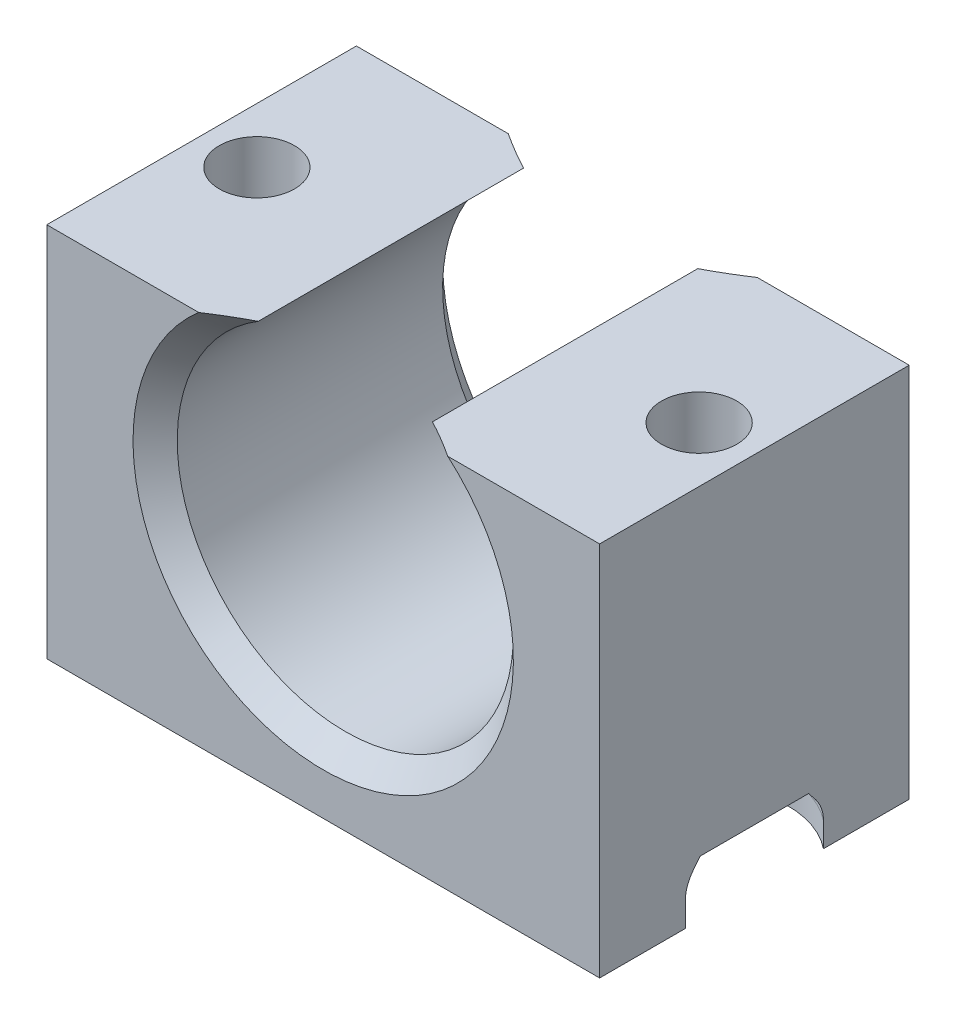
ISO-10303-21;
HEADER;
FILE_DESCRIPTION(('STEP AP214'),'2;1');
FILE_NAME('part.step','',(''),(''),'','','');
FILE_SCHEMA(('AUTOMOTIVE_DESIGN { 1 0 10303 214 1 1 1 1 }'));
ENDSEC;
DATA;
#1=APPLICATION_CONTEXT('core data for automotive mechanical design processes');
#2=APPLICATION_PROTOCOL_DEFINITION('international standard','automotive_design',2000,#1);
#3=PRODUCT_CONTEXT('',#1,'mechanical');
#4=PRODUCT('Part','Part','',(#3));
#5=PRODUCT_RELATED_PRODUCT_CATEGORY('part','',(#4));
#6=PRODUCT_DEFINITION_FORMATION('','',#4);
#7=PRODUCT_DEFINITION_CONTEXT('part definition',#1,'design');
#8=PRODUCT_DEFINITION('design','',#6,#7);
#9=PRODUCT_DEFINITION_SHAPE('','',#8);
#10=(LENGTH_UNIT() NAMED_UNIT(*) SI_UNIT(.MILLI.,.METRE.));
#11=(NAMED_UNIT(*) PLANE_ANGLE_UNIT() SI_UNIT($,.RADIAN.));
#12=(NAMED_UNIT(*) SI_UNIT($,.STERADIAN.) SOLID_ANGLE_UNIT());
#13=UNCERTAINTY_MEASURE_WITH_UNIT(LENGTH_MEASURE(1.E-05),#10,'distance_accuracy_value','');
#14=(GEOMETRIC_REPRESENTATION_CONTEXT(3) GLOBAL_UNCERTAINTY_ASSIGNED_CONTEXT((#13)) GLOBAL_UNIT_ASSIGNED_CONTEXT((#10,
#11,#12)) REPRESENTATION_CONTEXT('',''));
#15=CARTESIAN_POINT('',(0.,0.,0.));
#16=DIRECTION('',(0.,0.,1.));
#17=DIRECTION('',(1.,0.,0.));
#18=AXIS2_PLACEMENT_3D('',#15,#16,#17);
#19=CARTESIAN_POINT('',(22.5,17.,-7.));
#20=DIRECTION('',(0.,1.,0.));
#21=DIRECTION('',(0.,0.,1.));
#22=AXIS2_PLACEMENT_3D('',#19,#20,#21);
#23=CYLINDRICAL_SURFACE('',#22,1.69999999999999);
#24=CARTESIAN_POINT('',(22.5,17.,-7.));
#25=DIRECTION('',(0.,1.,0.));
#26=DIRECTION('',(0.,0.,1.));
#27=AXIS2_PLACEMENT_3D('',#24,#25,#26);
#28=CIRCLE('',#27,1.69999999999999);
#29=CARTESIAN_POINT('',(22.5,17.,-5.30000000000001));
#30=VERTEX_POINT('',#29);
#31=EDGE_CURVE('E347',#30,#30,#28,.T.);
#32=ORIENTED_EDGE('',*,*,#31,.T.);
#33=EDGE_LOOP('',(#32));
#34=FACE_BOUND('',#33,.T.);
#35=CARTESIAN_POINT('',(22.5,2.5,-7.));
#36=DIRECTION('',(0.,-1.,0.));
#37=DIRECTION('',(0.,0.,-1.));
#38=AXIS2_PLACEMENT_3D('',#35,#36,#37);
#39=CIRCLE('',#38,1.69999999999999);
#40=CARTESIAN_POINT('',(22.5,2.5,-8.69999999999999));
#41=VERTEX_POINT('',#40);
#42=EDGE_CURVE('E171',#41,#41,#39,.F.);
#43=ORIENTED_EDGE('',*,*,#42,.F.);
#44=EDGE_LOOP('',(#43));
#45=FACE_BOUND('',#44,.T.);
#46=ADVANCED_FACE('F33',(#34,#45),#23,.F.);
#47=CARTESIAN_POINT('',(2.5,17.,-7.));
#48=DIRECTION('',(0.,1.,0.));
#49=DIRECTION('',(0.,0.,1.));
#50=AXIS2_PLACEMENT_3D('',#47,#48,#49);
#51=CYLINDRICAL_SURFACE('',#50,1.69999999999999);
#52=CARTESIAN_POINT('',(2.5,17.,-7.));
#53=DIRECTION('',(0.,1.,0.));
#54=DIRECTION('',(0.,0.,1.));
#55=AXIS2_PLACEMENT_3D('',#52,#53,#54);
#56=CIRCLE('',#55,1.69999999999999);
#57=CARTESIAN_POINT('',(2.5,17.,-5.30000000000001));
#58=VERTEX_POINT('',#57);
#59=EDGE_CURVE('E181',#58,#58,#56,.T.);
#60=ORIENTED_EDGE('',*,*,#59,.T.);
#61=EDGE_LOOP('',(#60));
#62=FACE_BOUND('',#61,.T.);
#63=CARTESIAN_POINT('',(2.5,2.5,-7.));
#64=DIRECTION('',(0.,-1.,0.));
#65=DIRECTION('',(0.,0.,-1.));
#66=AXIS2_PLACEMENT_3D('',#63,#64,#65);
#67=CIRCLE('',#66,1.69999999999999);
#68=CARTESIAN_POINT('',(2.5,2.5,-8.69999999999999));
#69=VERTEX_POINT('',#68);
#70=EDGE_CURVE('E210',#69,#69,#67,.F.);
#71=ORIENTED_EDGE('',*,*,#70,.F.);
#72=EDGE_LOOP('',(#71));
#73=FACE_BOUND('',#72,.T.);
#74=ADVANCED_FACE('F409',(#62,#73),#51,.F.);
#75=CARTESIAN_POINT('',(0.,17.,0.));
#76=DIRECTION('',(0.,0.,-1.));
#77=DIRECTION('',(-1.,0.,0.));
#78=AXIS2_PLACEMENT_3D('',#75,#76,#77);
#79=PLANE('',#78);
#80=DIRECTION('',(1.,0.,0.));
#81=VECTOR('',#80,1.);
#82=CARTESIAN_POINT('',(0.,17.,0.));
#83=LINE('',#82,#81);
#84=CARTESIAN_POINT('',(18.1311632901204,17.,0.));
#85=VERTEX_POINT('',#84);
#86=CARTESIAN_POINT('',(25.,17.,0.));
#87=VERTEX_POINT('',#86);
#88=EDGE_CURVE('E190',#85,#87,#83,.T.);
#89=ORIENTED_EDGE('',*,*,#88,.F.);
#90=CARTESIAN_POINT('',(12.5,10.5,0.));
#91=DIRECTION('',(0.,0.,-1.));
#92=DIRECTION('',(-1.,0.,0.));
#93=AXIS2_PLACEMENT_3D('',#90,#91,#92);
#94=CIRCLE('',#93,8.6);
#95=CARTESIAN_POINT('',(6.86883670987956,17.,0.));
#96=VERTEX_POINT('',#95);
#97=EDGE_CURVE('E263',#85,#96,#94,.T.);
#98=ORIENTED_EDGE('',*,*,#97,.T.);
#99=CARTESIAN_POINT('',(0.,17.,0.));
#100=VERTEX_POINT('',#99);
#101=EDGE_CURVE('E352',#100,#96,#83,.T.);
#102=ORIENTED_EDGE('',*,*,#101,.F.);
#103=DIRECTION('',(0.,-1.,0.));
#104=VECTOR('',#103,1.);
#105=CARTESIAN_POINT('',(0.,17.,0.));
#106=LINE('',#105,#104);
#107=CARTESIAN_POINT('',(0.,0.,0.));
#108=VERTEX_POINT('',#107);
#109=EDGE_CURVE('E191',#100,#108,#106,.T.);
#110=ORIENTED_EDGE('',*,*,#109,.T.);
#111=DIRECTION('',(1.,0.,0.));
#112=VECTOR('',#111,1.);
#113=CARTESIAN_POINT('',(0.,0.,0.));
#114=LINE('',#113,#112);
#115=CARTESIAN_POINT('',(25.,0.,0.));
#116=VERTEX_POINT('',#115);
#117=EDGE_CURVE('E178',#108,#116,#114,.T.);
#118=ORIENTED_EDGE('',*,*,#117,.T.);
#119=DIRECTION('',(0.,-1.,0.));
#120=VECTOR('',#119,1.);
#121=CARTESIAN_POINT('',(25.,17.,0.));
#122=LINE('',#121,#120);
#123=EDGE_CURVE('E200',#87,#116,#122,.T.);
#124=ORIENTED_EDGE('',*,*,#123,.F.);
#125=EDGE_LOOP('',(#89,#98,#102,#110,#118,#124));
#126=FACE_BOUND('',#125,.T.);
#127=ADVANCED_FACE('F373',(#126),#79,.F.);
#128=CARTESIAN_POINT('',(0.,17.,-14.));
#129=DIRECTION('',(0.,0.,1.));
#130=DIRECTION('',(1.,0.,0.));
#131=AXIS2_PLACEMENT_3D('',#128,#129,#130);
#132=PLANE('',#131);
#133=DIRECTION('',(-1.,0.,0.));
#134=VECTOR('',#133,1.);
#135=CARTESIAN_POINT('',(0.,17.,-14.));
#136=LINE('',#135,#134);
#137=CARTESIAN_POINT('',(6.86883670987956,17.,-14.));
#138=VERTEX_POINT('',#137);
#139=CARTESIAN_POINT('',(0.,17.,-14.));
#140=VERTEX_POINT('',#139);
#141=EDGE_CURVE('E357',#138,#140,#136,.T.);
#142=ORIENTED_EDGE('',*,*,#141,.F.);
#143=CARTESIAN_POINT('',(12.5,10.5,-14.));
#144=DIRECTION('',(0.,0.,1.));
#145=DIRECTION('',(1.,0.,0.));
#146=AXIS2_PLACEMENT_3D('',#143,#144,#145);
#147=CIRCLE('',#146,8.6);
#148=CARTESIAN_POINT('',(18.1311632901204,17.,-14.));
#149=VERTEX_POINT('',#148);
#150=EDGE_CURVE('E258',#138,#149,#147,.T.);
#151=ORIENTED_EDGE('',*,*,#150,.T.);
#152=CARTESIAN_POINT('',(25.,17.,-14.));
#153=VERTEX_POINT('',#152);
#154=EDGE_CURVE('E358',#153,#149,#136,.T.);
#155=ORIENTED_EDGE('',*,*,#154,.F.);
#156=DIRECTION('',(0.,-1.,0.));
#157=VECTOR('',#156,1.);
#158=CARTESIAN_POINT('',(25.,17.,-14.));
#159=LINE('',#158,#157);
#160=CARTESIAN_POINT('',(25.,0.,-14.));
#161=VERTEX_POINT('',#160);
#162=EDGE_CURVE('E198',#153,#161,#159,.T.);
#163=ORIENTED_EDGE('',*,*,#162,.T.);
#164=DIRECTION('',(-1.,0.,0.));
#165=VECTOR('',#164,1.);
#166=CARTESIAN_POINT('',(0.,0.,-14.));
#167=LINE('',#166,#165);
#168=CARTESIAN_POINT('',(0.,0.,-14.));
#169=VERTEX_POINT('',#168);
#170=EDGE_CURVE('E176',#161,#169,#167,.T.);
#171=ORIENTED_EDGE('',*,*,#170,.T.);
#172=DIRECTION('',(0.,-1.,0.));
#173=VECTOR('',#172,1.);
#174=CARTESIAN_POINT('',(0.,17.,-14.));
#175=LINE('',#174,#173);
#176=EDGE_CURVE('E194',#140,#169,#175,.T.);
#177=ORIENTED_EDGE('',*,*,#176,.F.);
#178=EDGE_LOOP('',(#142,#151,#155,#163,#171,#177));
#179=FACE_BOUND('',#178,.T.);
#180=ADVANCED_FACE('F285',(#179),#132,.F.);
#181=CARTESIAN_POINT('',(0.,17.,0.));
#182=DIRECTION('',(0.,1.,0.));
#183=DIRECTION('',(0.,0.,1.));
#184=AXIS2_PLACEMENT_3D('',#181,#182,#183);
#185=PLANE('',#184);
#186=ORIENTED_EDGE('',*,*,#31,.F.);
#187=EDGE_LOOP('',(#186));
#188=FACE_BOUND('',#187,.T.);
#189=ORIENTED_EDGE('',*,*,#154,.T.);
#190=CARTESIAN_POINT('',(18.1311632901204,17.,-14.));
#191=CARTESIAN_POINT('',(17.9939914052336,17.,-13.9101961815131));
#192=CARTESIAN_POINT('',(17.8559648519208,17.,-13.8216787443388));
#193=CARTESIAN_POINT('',(17.5780968988901,17.,-13.647743701916));
#194=CARTESIAN_POINT('',(17.4382567127376,17.,-13.5623241557396));
#195=CARTESIAN_POINT('',(17.1564642462588,17.,-13.3949859631923));
#196=CARTESIAN_POINT('',(17.0145117091538,17.,-13.3130677472103));
#197=CARTESIAN_POINT('',(16.728216057136,17.,-13.1533067179775));
#198=CARTESIAN_POINT('',(16.583871472987,17.,-13.0754665416372));
#199=CARTESIAN_POINT('',(16.438273733503,17.,-13.));
#200=B_SPLINE_CURVE_WITH_KNOTS('',3,(#190,#191,#192,#193,#194,#195,#196,#197,#198,#199),
.UNSPECIFIED.,.F.,.F.,(4,2,2,2,4),(0.,0.491869108229432,0.983424524917862,1.47504019159015,
1.96696991591148),.UNSPECIFIED.);
#201=CARTESIAN_POINT('',(16.438273733503,17.,-13.));
#202=VERTEX_POINT('',#201);
#203=EDGE_CURVE('E257',#149,#202,#200,.T.);
#204=ORIENTED_EDGE('',*,*,#203,.T.);
#205=DIRECTION('',(0.,0.,-1.));
#206=VECTOR('',#205,1.);
#207=CARTESIAN_POINT('',(16.438273733503,17.,41.6458281223942));
#208=LINE('',#207,#206);
#209=CARTESIAN_POINT('',(16.438273733503,17.,-1.00000000000001));
#210=VERTEX_POINT('',#209);
#211=EDGE_CURVE('E206',#202,#210,#208,.F.);
#212=ORIENTED_EDGE('',*,*,#211,.T.);
#213=CARTESIAN_POINT('',(16.438273733503,17.,-1.00000000000001));
#214=CARTESIAN_POINT('',(16.583871472987,17.,-0.924533458362819));
#215=CARTESIAN_POINT('',(16.728216057136,17.,-0.846693282022524));
#216=CARTESIAN_POINT('',(17.0145117091538,17.,-0.686932252789671));
#217=CARTESIAN_POINT('',(17.1564642462588,17.,-0.605014036807677));
#218=CARTESIAN_POINT('',(17.4382567127376,17.,-0.437675844260445));
#219=CARTESIAN_POINT('',(17.5780968988901,17.,-0.352256298084048));
#220=CARTESIAN_POINT('',(17.8559648519208,17.,-0.178321255661194));
#221=CARTESIAN_POINT('',(17.9939914052336,17.,-0.0898038184869356));
#222=CARTESIAN_POINT('',(18.1311632901204,17.,0.));
#223=B_SPLINE_CURVE_WITH_KNOTS('',3,(#213,#214,#215,#216,#217,#218,#219,#220,#221,#222),
.UNSPECIFIED.,.F.,.F.,(4,2,2,2,4),(0.,0.491929724321333,0.98354539099362,1.47510080768205,
1.96696991591148),.UNSPECIFIED.);
#224=EDGE_CURVE('E252',#210,#85,#223,.T.);
#225=ORIENTED_EDGE('',*,*,#224,.T.);
#226=ORIENTED_EDGE('',*,*,#88,.T.);
#227=DIRECTION('',(0.,0.,-1.));
#228=VECTOR('',#227,1.);
#229=CARTESIAN_POINT('',(25.,17.,0.));
#230=LINE('',#229,#228);
#231=EDGE_CURVE('E355',#87,#153,#230,.T.);
#232=ORIENTED_EDGE('',*,*,#231,.T.);
#233=EDGE_LOOP('',(#189,#204,#212,#225,#226,#232));
#234=FACE_BOUND('',#233,.T.);
#235=ADVANCED_FACE('F235',(#188,#234),#185,.T.);
#236=ORIENTED_EDGE('',*,*,#59,.F.);
#237=EDGE_LOOP('',(#236));
#238=FACE_BOUND('',#237,.T.);
#239=DIRECTION('',(0.,0.,-1.));
#240=VECTOR('',#239,1.);
#241=CARTESIAN_POINT('',(8.56172626649696,17.,41.6458281223942));
#242=LINE('',#241,#240);
#243=CARTESIAN_POINT('',(8.56172626649696,17.,-1.00000000000001));
#244=VERTEX_POINT('',#243);
#245=CARTESIAN_POINT('',(8.56172626649696,17.,-13.));
#246=VERTEX_POINT('',#245);
#247=EDGE_CURVE('E203',#244,#246,#242,.T.);
#248=ORIENTED_EDGE('',*,*,#247,.T.);
#249=CARTESIAN_POINT('',(8.56172626649696,17.,-13.));
#250=CARTESIAN_POINT('',(8.41612852701299,17.,-13.0754665416372));
#251=CARTESIAN_POINT('',(8.27178394286398,17.,-13.1533067179775));
#252=CARTESIAN_POINT('',(7.98548829084617,17.,-13.3130677472103));
#253=CARTESIAN_POINT('',(7.84353575374125,17.,-13.3949859631923));
#254=CARTESIAN_POINT('',(7.56174328726243,17.,-13.5623241557396));
#255=CARTESIAN_POINT('',(7.42190310110989,17.,-13.647743701916));
#256=CARTESIAN_POINT('',(7.14403514807922,17.,-13.8216787443388));
#257=CARTESIAN_POINT('',(7.00600859476642,17.,-13.9101961815131));
#258=CARTESIAN_POINT('',(6.86883670987956,17.,-14.));
#259=B_SPLINE_CURVE_WITH_KNOTS('',3,(#249,#250,#251,#252,#253,#254,#255,#256,#257,#258),
.UNSPECIFIED.,.F.,.F.,(4,2,2,2,4),(0.,0.491929724321333,0.983545390993616,1.47510080768205,
1.96696991591148),.UNSPECIFIED.);
#260=EDGE_CURVE('E229',#246,#138,#259,.T.);
#261=ORIENTED_EDGE('',*,*,#260,.T.);
#262=ORIENTED_EDGE('',*,*,#141,.T.);
#263=DIRECTION('',(0.,0.,1.));
#264=VECTOR('',#263,1.);
#265=CARTESIAN_POINT('',(0.,17.,0.));
#266=LINE('',#265,#264);
#267=EDGE_CURVE('E195',#140,#100,#266,.T.);
#268=ORIENTED_EDGE('',*,*,#267,.T.);
#269=ORIENTED_EDGE('',*,*,#101,.T.);
#270=CARTESIAN_POINT('',(6.86883670987956,17.,0.));
#271=CARTESIAN_POINT('',(7.00600859476642,17.,-0.0898038184869348));
#272=CARTESIAN_POINT('',(7.14403514807922,17.,-0.178321255661193));
#273=CARTESIAN_POINT('',(7.42190310110988,17.,-0.352256298084048));
#274=CARTESIAN_POINT('',(7.56174328726243,17.,-0.437675844260445));
#275=CARTESIAN_POINT('',(7.84353575374124,17.,-0.605014036807677));
#276=CARTESIAN_POINT('',(7.98548829084617,17.,-0.68693225278967));
#277=CARTESIAN_POINT('',(8.27178394286398,17.,-0.846693282022523));
#278=CARTESIAN_POINT('',(8.41612852701299,17.,-0.92453345836282));
#279=CARTESIAN_POINT('',(8.56172626649696,17.,-1.00000000000001));
#280=B_SPLINE_CURVE_WITH_KNOTS('',3,(#270,#271,#272,#273,#274,#275,#276,#277,#278,#279),
.UNSPECIFIED.,.F.,.F.,(4,2,2,2,4),(0.,0.491869108229435,0.983424524917869,1.47504019159015,
1.96696991591149),.UNSPECIFIED.);
#281=EDGE_CURVE('E222',#96,#244,#280,.T.);
#282=ORIENTED_EDGE('',*,*,#281,.T.);
#283=EDGE_LOOP('',(#248,#261,#262,#268,#269,#282));
#284=FACE_BOUND('',#283,.T.);
#285=ADVANCED_FACE('F363',(#238,#284),#185,.T.);
#286=CARTESIAN_POINT('',(25.,17.,0.));
#287=DIRECTION('',(-1.,0.,0.));
#288=DIRECTION('',(0.,0.,1.));
#289=AXIS2_PLACEMENT_3D('',#286,#287,#288);
#290=PLANE('',#289);
#291=DIRECTION('',(0.,0.,1.));
#292=VECTOR('',#291,1.);
#293=CARTESIAN_POINT('',(25.,2.5,0.));
#294=LINE('',#293,#292);
#295=CARTESIAN_POINT('',(25.,2.5,-9.44948974278318));
#296=VERTEX_POINT('',#295);
#297=CARTESIAN_POINT('',(25.,2.5,-4.55051025721682));
#298=VERTEX_POINT('',#297);
#299=EDGE_CURVE('E216',#296,#298,#294,.T.);
#300=ORIENTED_EDGE('',*,*,#299,.F.);
#301=CARTESIAN_POINT('',(25.,2.5,-9.44948974278318));
#302=CARTESIAN_POINT('',(25.,2.4294733356692,-9.50766035781997));
#303=CARTESIAN_POINT('',(25.,2.35844129345759,-9.56521269435654));
#304=CARTESIAN_POINT('',(25.,2.21552351405224,-9.67922278082085));
#305=CARTESIAN_POINT('',(25.,2.14363792619725,-9.73568071780664));
#306=CARTESIAN_POINT('',(25.,1.99914828070792,-9.84766192747402));
#307=CARTESIAN_POINT('',(25.,1.9265442489228,-9.90318523359038));
#308=CARTESIAN_POINT('',(25.,1.78070461222064,-10.0134228784778));
#309=CARTESIAN_POINT('',(25.,1.70746890069388,-10.0681370762904));
#310=CARTESIAN_POINT('',(25.,1.63397459621556,-10.1224989991992));
#311=B_SPLINE_CURVE_WITH_KNOTS('',3,(#301,#302,#303,#304,#305,#306,#307,#308,#309,#310),
.UNSPECIFIED.,.F.,.F.,(4,2,2,2,4),(0.,0.274254954675614,0.548462612010202,0.822660439116222,
1.0969054856877),.UNSPECIFIED.);
#312=CARTESIAN_POINT('',(25.,2.09807621135343,-9.77095709643372));
#313=VERTEX_POINT('',#312);
#314=EDGE_CURVE('E314',#296,#313,#311,.T.);
#315=ORIENTED_EDGE('',*,*,#314,.T.);
#316=CARTESIAN_POINT('',(25.,2.09807621135331,-9.77095709643357));
#317=CARTESIAN_POINT('',(25.,2.0612931548606,-9.79956200884437));
#318=CARTESIAN_POINT('',(25.,2.02339987139946,-9.82672066514273));
#319=CARTESIAN_POINT('',(25.,1.94553620900424,-9.87791174928239));
#320=CARTESIAN_POINT('',(25.,1.90556495606887,-9.90194284652765));
#321=CARTESIAN_POINT('',(25.,1.78512104477125,-9.96769098627659));
#322=CARTESIAN_POINT('',(25.,1.70200790830729,-10.0047099476673));
#323=CARTESIAN_POINT('',(25.,1.53430717359766,-10.0630092048468));
#324=CARTESIAN_POINT('',(25.,1.44992672103153,-10.0848831378633));
#325=CARTESIAN_POINT('',(25.,1.32042809370499,-10.1072410963697));
#326=CARTESIAN_POINT('',(25.,1.27616359456969,-10.1129540956259));
#327=CARTESIAN_POINT('',(25.,1.18729796663831,-10.1205851637684));
#328=CARTESIAN_POINT('',(25.,1.14269675770173,-10.1225022986561));
#329=CARTESIAN_POINT('',(25.,1.09807621135332,-10.1224989991992));
#330=B_SPLINE_CURVE_WITH_KNOTS('',3,(#316,#317,#318,#319,#320,#321,#322,#323,#324,#325,#326,
#327,#328,#329),.UNSPECIFIED.,.F.,.F.,(4,2,2,2,2,2,4),(0.,0.139726029972453,0.279511312330738,
0.551145966164612,0.811416794455071,0.945166682001693,1.07894947554622),.UNSPECIFIED.);
#331=CARTESIAN_POINT('',(25.,1.09807621135332,-10.1224989991992));
#332=VERTEX_POINT('',#331);
#333=EDGE_CURVE('E158',#313,#332,#330,.T.);
#334=ORIENTED_EDGE('',*,*,#333,.T.);
#335=DIRECTION('',(0.,-1.,0.));
#336=VECTOR('',#335,1.);
#337=CARTESIAN_POINT('',(25.,2.5,-10.1224989991992));
#338=LINE('',#337,#336);
#339=CARTESIAN_POINT('',(25.,0.,-10.1224989991992));
#340=VERTEX_POINT('',#339);
#341=EDGE_CURVE('E148',#332,#340,#338,.T.);
#342=ORIENTED_EDGE('',*,*,#341,.T.);
#343=DIRECTION('',(0.,0.,-1.));
#344=VECTOR('',#343,1.);
#345=CARTESIAN_POINT('',(25.,0.,0.));
#346=LINE('',#345,#344);
#347=EDGE_CURVE('E154',#340,#161,#346,.T.);
#348=ORIENTED_EDGE('',*,*,#347,.T.);
#349=ORIENTED_EDGE('',*,*,#162,.F.);
#350=ORIENTED_EDGE('',*,*,#231,.F.);
#351=ORIENTED_EDGE('',*,*,#123,.T.);
#352=CARTESIAN_POINT('',(25.,0.,-3.8775010008008));
#353=VERTEX_POINT('',#352);
#354=EDGE_CURVE('E177',#116,#353,#346,.T.);
#355=ORIENTED_EDGE('',*,*,#354,.T.);
#356=DIRECTION('',(0.,-1.,0.));
#357=VECTOR('',#356,1.);
#358=CARTESIAN_POINT('',(25.,2.5,-3.8775010008008));
#359=LINE('',#358,#357);
#360=CARTESIAN_POINT('',(25.,1.09807621135332,-3.8775010008008));
#361=VERTEX_POINT('',#360);
#362=EDGE_CURVE('E163',#353,#361,#359,.F.);
#363=ORIENTED_EDGE('',*,*,#362,.T.);
#364=CARTESIAN_POINT('',(25.,1.09807621135332,-3.8775010008008));
#365=CARTESIAN_POINT('',(25.,1.14459996288282,-3.87749765353823));
#366=CARTESIAN_POINT('',(25.,1.19110052417222,-3.87958186907263));
#367=CARTESIAN_POINT('',(25.,1.28372123385489,-3.88787512246337));
#368=CARTESIAN_POINT('',(25.,1.32984147217708,-3.89408315516168));
#369=CARTESIAN_POINT('',(25.,1.46459094832765,-3.91835544083346));
#370=CARTESIAN_POINT('',(25.,1.55225966992537,-3.94207973238618));
#371=CARTESIAN_POINT('',(25.,1.71914868188715,-4.00267511231386));
#372=CARTESIAN_POINT('',(25.,1.79856262880604,-4.03901883812001));
#373=CARTESIAN_POINT('',(25.,1.91374357309117,-4.1029120155424));
#374=CARTESIAN_POINT('',(25.,1.95196435644743,-4.12615015430528));
#375=CARTESIAN_POINT('',(25.,2.02648940832073,-4.17549708009296));
#376=CARTESIAN_POINT('',(25.,2.06279429053835,-4.20160493952728));
#377=CARTESIAN_POINT('',(25.,2.09807621135331,-4.22904290356643));
#378=B_SPLINE_CURVE_WITH_KNOTS('',3,(#364,#365,#366,#367,#368,#369,#370,#371,#372,#373,#374,
#375,#376,#377),.UNSPECIFIED.,.F.,.F.,(4,2,2,2,2,2,4),(0.,0.139479425151139,0.278924865419262,
0.549974274335852,0.810841256409605,0.944916193747442,1.07894792028271),.UNSPECIFIED.);
#379=CARTESIAN_POINT('',(25.,2.09807621135343,-4.22904290356628));
#380=VERTEX_POINT('',#379);
#381=EDGE_CURVE('E298',#361,#380,#378,.T.);
#382=ORIENTED_EDGE('',*,*,#381,.T.);
#383=CARTESIAN_POINT('',(25.,1.63397459621556,-3.8775010008008));
#384=CARTESIAN_POINT('',(25.,1.70746890069388,-3.93186292370959));
#385=CARTESIAN_POINT('',(25.,1.78070461222064,-3.9865771215222));
#386=CARTESIAN_POINT('',(25.,1.9265442489228,-4.09681476640962));
#387=CARTESIAN_POINT('',(25.,1.99914828070792,-4.15233807252598));
#388=CARTESIAN_POINT('',(25.,2.14363792619725,-4.26431928219336));
#389=CARTESIAN_POINT('',(25.,2.21552351405224,-4.32077721917915));
#390=CARTESIAN_POINT('',(25.,2.35844129345759,-4.43478730564346));
#391=CARTESIAN_POINT('',(25.,2.4294733356692,-4.49233964218003));
#392=CARTESIAN_POINT('',(25.,2.5,-4.55051025721682));
#393=B_SPLINE_CURVE_WITH_KNOTS('',3,(#383,#384,#385,#386,#387,#388,#389,#390,#391,#392),
.UNSPECIFIED.,.F.,.F.,(4,2,2,2,4),(0.,0.274245046571477,0.548442873677496,0.822650531012084,
1.0969054856877),.UNSPECIFIED.);
#394=EDGE_CURVE('E319',#380,#298,#393,.T.);
#395=ORIENTED_EDGE('',*,*,#394,.T.);
#396=EDGE_LOOP('',(#300,#315,#334,#342,#348,#349,#350,#351,#355,#363,#382,#395));
#397=FACE_BOUND('',#396,.T.);
#398=ADVANCED_FACE('F151',(#397),#290,.F.);
#399=CARTESIAN_POINT('',(0.,17.,0.));
#400=DIRECTION('',(1.,0.,0.));
#401=DIRECTION('',(0.,0.,-1.));
#402=AXIS2_PLACEMENT_3D('',#399,#400,#401);
#403=PLANE('',#402);
#404=DIRECTION('',(0.,0.,-1.));
#405=VECTOR('',#404,1.);
#406=CARTESIAN_POINT('',(0.,2.5,0.));
#407=LINE('',#406,#405);
#408=CARTESIAN_POINT('',(0.,2.5,-4.55051025721682));
#409=VERTEX_POINT('',#408);
#410=CARTESIAN_POINT('',(0.,2.5,-9.44948974278318));
#411=VERTEX_POINT('',#410);
#412=EDGE_CURVE('E213',#409,#411,#407,.T.);
#413=ORIENTED_EDGE('',*,*,#412,.F.);
#414=CARTESIAN_POINT('',(0.,2.5,-4.55051025721682));
#415=CARTESIAN_POINT('',(0.,2.4294733356692,-4.49233964218003));
#416=CARTESIAN_POINT('',(0.,2.35844129345759,-4.43478730564346));
#417=CARTESIAN_POINT('',(0.,2.21552351405224,-4.32077721917915));
#418=CARTESIAN_POINT('',(0.,2.14363792619725,-4.26431928219336));
#419=CARTESIAN_POINT('',(0.,1.99914828070792,-4.15233807252598));
#420=CARTESIAN_POINT('',(0.,1.9265442489228,-4.09681476640962));
#421=CARTESIAN_POINT('',(0.,1.78070461222064,-3.9865771215222));
#422=CARTESIAN_POINT('',(0.,1.70746890069388,-3.93186292370959));
#423=CARTESIAN_POINT('',(0.,1.63397459621555,-3.8775010008008));
#424=B_SPLINE_CURVE_WITH_KNOTS('',3,(#414,#415,#416,#417,#418,#419,#420,#421,#422,#423),
.UNSPECIFIED.,.F.,.F.,(4,2,2,2,4),(0.,0.274254954675614,0.548462612010204,0.822660439116225,
1.0969054856877),.UNSPECIFIED.);
#425=CARTESIAN_POINT('',(0.,2.09807621135342,-4.22904290356628));
#426=VERTEX_POINT('',#425);
#427=EDGE_CURVE('E271',#409,#426,#424,.T.);
#428=ORIENTED_EDGE('',*,*,#427,.T.);
#429=CARTESIAN_POINT('',(0.,2.0980762113533,-4.22904290356643));
#430=CARTESIAN_POINT('',(0.,2.06129315486059,-4.20043799115563));
#431=CARTESIAN_POINT('',(0.,2.02339987139945,-4.17327933485727));
#432=CARTESIAN_POINT('',(0.,1.94553620900424,-4.12208825071761));
#433=CARTESIAN_POINT('',(0.,1.90556495606887,-4.09805715347234));
#434=CARTESIAN_POINT('',(0.,1.78512104477125,-4.0323090137234));
#435=CARTESIAN_POINT('',(0.,1.70200790830729,-3.99529005233267));
#436=CARTESIAN_POINT('',(0.,1.53430717359765,-3.93699079515322));
#437=CARTESIAN_POINT('',(0.,1.44992672103153,-3.91511686213665));
#438=CARTESIAN_POINT('',(0.,1.32042809370499,-3.89275890363025));
#439=CARTESIAN_POINT('',(0.,1.27616359456969,-3.88704590437413));
#440=CARTESIAN_POINT('',(0.,1.1872979666383,-3.87941483623158));
#441=CARTESIAN_POINT('',(0.,1.14269675770173,-3.87749770134386));
#442=CARTESIAN_POINT('',(0.,1.09807621135332,-3.8775010008008));
#443=B_SPLINE_CURVE_WITH_KNOTS('',3,(#429,#430,#431,#432,#433,#434,#435,#436,#437,#438,#439,
#440,#441,#442),.UNSPECIFIED.,.F.,.F.,(4,2,2,2,2,2,4),(0.,0.139726029972452,0.279511312330738,
0.551145966164611,0.811416794455069,0.945166682001692,1.07894947554622),.UNSPECIFIED.);
#444=CARTESIAN_POINT('',(0.,1.09807621135332,-3.8775010008008));
#445=VERTEX_POINT('',#444);
#446=EDGE_CURVE('E11',#426,#445,#443,.T.);
#447=ORIENTED_EDGE('',*,*,#446,.T.);
#448=DIRECTION('',(0.,-1.,0.));
#449=VECTOR('',#448,1.);
#450=CARTESIAN_POINT('',(0.,2.5,-3.8775010008008));
#451=LINE('',#450,#449);
#452=CARTESIAN_POINT('',(0.,0.,-3.8775010008008));
#453=VERTEX_POINT('',#452);
#454=EDGE_CURVE('E345',#445,#453,#451,.T.);
#455=ORIENTED_EDGE('',*,*,#454,.T.);
#456=DIRECTION('',(0.,0.,1.));
#457=VECTOR('',#456,1.);
#458=CARTESIAN_POINT('',(0.,0.,0.));
#459=LINE('',#458,#457);
#460=EDGE_CURVE('E186',#453,#108,#459,.T.);
#461=ORIENTED_EDGE('',*,*,#460,.T.);
#462=ORIENTED_EDGE('',*,*,#109,.F.);
#463=ORIENTED_EDGE('',*,*,#267,.F.);
#464=ORIENTED_EDGE('',*,*,#176,.T.);
#465=CARTESIAN_POINT('',(0.,0.,-10.1224989991992));
#466=VERTEX_POINT('',#465);
#467=EDGE_CURVE('E187',#169,#466,#459,.T.);
#468=ORIENTED_EDGE('',*,*,#467,.T.);
#469=DIRECTION('',(0.,-1.,0.));
#470=VECTOR('',#469,1.);
#471=CARTESIAN_POINT('',(0.,2.5,-10.1224989991992));
#472=LINE('',#471,#470);
#473=CARTESIAN_POINT('',(0.,1.09807621135332,-10.1224989991992));
#474=VERTEX_POINT('',#473);
#475=EDGE_CURVE('E343',#466,#474,#472,.F.);
#476=ORIENTED_EDGE('',*,*,#475,.T.);
#477=CARTESIAN_POINT('',(0.,1.09807621135332,-10.1224989991992));
#478=CARTESIAN_POINT('',(0.,1.14459996288281,-10.1225023464618));
#479=CARTESIAN_POINT('',(0.,1.19110052417222,-10.1204181309274));
#480=CARTESIAN_POINT('',(0.,1.28372123385488,-10.1121248775366));
#481=CARTESIAN_POINT('',(0.,1.32984147217708,-10.1059168448383));
#482=CARTESIAN_POINT('',(0.,1.46459094832764,-10.0816445591665));
#483=CARTESIAN_POINT('',(0.,1.55225966992536,-10.0579202676138));
#484=CARTESIAN_POINT('',(0.,1.71914868188715,-9.99732488768614));
#485=CARTESIAN_POINT('',(0.,1.79856262880603,-9.96098116187999));
#486=CARTESIAN_POINT('',(0.,1.91374357309116,-9.8970879844576));
#487=CARTESIAN_POINT('',(0.,1.95196435644743,-9.87384984569473));
#488=CARTESIAN_POINT('',(0.,2.02648940832072,-9.82450291990704));
#489=CARTESIAN_POINT('',(0.,2.06279429053835,-9.79839506047272));
#490=CARTESIAN_POINT('',(0.,2.0980762113533,-9.77095709643357));
#491=B_SPLINE_CURVE_WITH_KNOTS('',3,(#477,#478,#479,#480,#481,#482,#483,#484,#485,#486,#487,
#488,#489,#490),.UNSPECIFIED.,.F.,.F.,(4,2,2,2,2,2,4),(0.,0.139479425151139,0.278924865419262,
0.549974274335852,0.810841256409603,0.944916193747441,1.07894792028271),.UNSPECIFIED.);
#492=CARTESIAN_POINT('',(0.,2.09807621135342,-9.77095709643372));
#493=VERTEX_POINT('',#492);
#494=EDGE_CURVE('E46',#474,#493,#491,.T.);
#495=ORIENTED_EDGE('',*,*,#494,.T.);
#496=CARTESIAN_POINT('',(0.,1.63397459621555,-10.1224989991992));
#497=CARTESIAN_POINT('',(0.,1.70746890069388,-10.0681370762904));
#498=CARTESIAN_POINT('',(0.,1.78070461222064,-10.0134228784778));
#499=CARTESIAN_POINT('',(0.,1.9265442489228,-9.90318523359038));
#500=CARTESIAN_POINT('',(0.,1.99914828070792,-9.84766192747402));
#501=CARTESIAN_POINT('',(0.,2.14363792619725,-9.73568071780664));
#502=CARTESIAN_POINT('',(0.,2.21552351405224,-9.67922278082085));
#503=CARTESIAN_POINT('',(0.,2.35844129345759,-9.56521269435654));
#504=CARTESIAN_POINT('',(0.,2.4294733356692,-9.50766035781997));
#505=CARTESIAN_POINT('',(0.,2.5,-9.44948974278318));
#506=B_SPLINE_CURVE_WITH_KNOTS('',3,(#496,#497,#498,#499,#500,#501,#502,#503,#504,#505),
.UNSPECIFIED.,.F.,.F.,(4,2,2,2,4),(0.,0.274245046571478,0.548442873677498,0.822650531012089,
1.0969054856877),.UNSPECIFIED.);
#507=EDGE_CURVE('E276',#493,#411,#506,.T.);
#508=ORIENTED_EDGE('',*,*,#507,.T.);
#509=EDGE_LOOP('',(#413,#428,#447,#455,#461,#462,#463,#464,#468,#476,#495,#508));
#510=FACE_BOUND('',#509,.T.);
#511=ADVANCED_FACE('F281',(#510),#403,.F.);
#512=CARTESIAN_POINT('',(0.,0.,0.));
#513=DIRECTION('',(0.,1.,0.));
#514=DIRECTION('',(0.,0.,1.));
#515=AXIS2_PLACEMENT_3D('',#512,#513,#514);
#516=PLANE('',#515);
#517=ORIENTED_EDGE('',*,*,#347,.F.);
#518=CARTESIAN_POINT('',(22.5,0.,-7.));
#519=DIRECTION('',(0.,-1.,0.));
#520=DIRECTION('',(0.,0.,-1.));
#521=AXIS2_PLACEMENT_3D('',#518,#519,#520);
#522=CIRCLE('',#521,4.);
#523=EDGE_CURVE('E166',#353,#340,#522,.T.);
#524=ORIENTED_EDGE('',*,*,#523,.F.);
#525=ORIENTED_EDGE('',*,*,#354,.F.);
#526=ORIENTED_EDGE('',*,*,#117,.F.);
#527=ORIENTED_EDGE('',*,*,#460,.F.);
#528=CARTESIAN_POINT('',(2.5,0.,-7.));
#529=DIRECTION('',(0.,-1.,0.));
#530=DIRECTION('',(0.,0.,-1.));
#531=AXIS2_PLACEMENT_3D('',#528,#529,#530);
#532=CIRCLE('',#531,4.);
#533=EDGE_CURVE('E162',#466,#453,#532,.T.);
#534=ORIENTED_EDGE('',*,*,#533,.F.);
#535=ORIENTED_EDGE('',*,*,#467,.F.);
#536=ORIENTED_EDGE('',*,*,#170,.F.);
#537=EDGE_LOOP('',(#517,#524,#525,#526,#527,#534,#535,#536));
#538=FACE_BOUND('',#537,.T.);
#539=ADVANCED_FACE('F174',(#538),#516,.F.);
#540=CARTESIAN_POINT('',(12.5,10.5,41.6458281223942));
#541=DIRECTION('',(0.,0.,-1.));
#542=DIRECTION('',(-1.,0.,0.));
#543=AXIS2_PLACEMENT_3D('',#540,#541,#542);
#544=CYLINDRICAL_SURFACE('',#543,7.6);
#545=ORIENTED_EDGE('',*,*,#211,.F.);
#546=CARTESIAN_POINT('',(12.5,10.5,-13.));
#547=DIRECTION('',(0.,0.,1.));
#548=DIRECTION('',(1.,0.,0.));
#549=AXIS2_PLACEMENT_3D('',#546,#547,#548);
#550=CIRCLE('',#549,7.6);
#551=EDGE_CURVE('E219',#202,#246,#550,.F.);
#552=ORIENTED_EDGE('',*,*,#551,.T.);
#553=ORIENTED_EDGE('',*,*,#247,.F.);
#554=CARTESIAN_POINT('',(12.5,10.5,-1.00000000000001));
#555=DIRECTION('',(0.,0.,-1.));
#556=DIRECTION('',(-1.,0.,0.));
#557=AXIS2_PLACEMENT_3D('',#554,#555,#556);
#558=CIRCLE('',#557,7.6);
#559=EDGE_CURVE('E209',#244,#210,#558,.F.);
#560=ORIENTED_EDGE('',*,*,#559,.T.);
#561=EDGE_LOOP('',(#545,#552,#553,#560));
#562=FACE_BOUND('',#561,.T.);
#563=ADVANCED_FACE('F380',(#562),#544,.F.);
#564=CARTESIAN_POINT('',(2.5,2.5,-7.));
#565=DIRECTION('',(0.,-1.,0.));
#566=DIRECTION('',(0.,0.,-1.));
#567=AXIS2_PLACEMENT_3D('',#564,#565,#566);
#568=CYLINDRICAL_SURFACE('',#567,4.);
#569=ORIENTED_EDGE('',*,*,#454,.F.);
#570=CARTESIAN_POINT('',(2.5,1.09807621135332,-7.));
#571=DIRECTION('',(0.,1.,0.));
#572=DIRECTION('',(0.,0.,1.));
#573=AXIS2_PLACEMENT_3D('',#570,#571,#572);
#574=CIRCLE('',#573,4.);
#575=EDGE_CURVE('E328',#445,#474,#574,.T.);
#576=ORIENTED_EDGE('',*,*,#575,.T.);
#577=ORIENTED_EDGE('',*,*,#475,.F.);
#578=ORIENTED_EDGE('',*,*,#533,.T.);
#579=EDGE_LOOP('',(#569,#576,#577,#578));
#580=FACE_BOUND('',#579,.T.);
#581=ADVANCED_FACE('F392',(#580),#568,.F.);
#582=CARTESIAN_POINT('',(2.5,2.5,-7.));
#583=DIRECTION('',(0.,-1.,0.));
#584=DIRECTION('',(0.,0.,-1.));
#585=AXIS2_PLACEMENT_3D('',#582,#583,#584);
#586=PLANE('',#585);
#587=ORIENTED_EDGE('',*,*,#70,.T.);
#588=EDGE_LOOP('',(#587));
#589=FACE_BOUND('',#588,.T.);
#590=ORIENTED_EDGE('',*,*,#412,.T.);
#591=CARTESIAN_POINT('',(2.5,2.5,-7.));
#592=DIRECTION('',(0.,-1.,0.));
#593=DIRECTION('',(0.,0.,-1.));
#594=AXIS2_PLACEMENT_3D('',#591,#592,#593);
#595=CIRCLE('',#594,3.5);
#596=EDGE_CURVE('E265',#411,#409,#595,.T.);
#597=ORIENTED_EDGE('',*,*,#596,.T.);
#598=EDGE_LOOP('',(#590,#597));
#599=FACE_BOUND('',#598,.T.);
#600=ADVANCED_FACE('F398',(#589,#599),#586,.T.);
#601=CARTESIAN_POINT('',(22.5,2.5,-7.));
#602=DIRECTION('',(0.,-1.,0.));
#603=DIRECTION('',(0.,0.,-1.));
#604=AXIS2_PLACEMENT_3D('',#601,#602,#603);
#605=CYLINDRICAL_SURFACE('',#604,4.);
#606=ORIENTED_EDGE('',*,*,#341,.F.);
#607=CARTESIAN_POINT('',(22.5,1.09807621135332,-7.));
#608=DIRECTION('',(0.,1.,0.));
#609=DIRECTION('',(0.,0.,1.));
#610=AXIS2_PLACEMENT_3D('',#607,#608,#609);
#611=CIRCLE('',#610,4.);
#612=EDGE_CURVE('E324',#332,#361,#611,.T.);
#613=ORIENTED_EDGE('',*,*,#612,.T.);
#614=ORIENTED_EDGE('',*,*,#362,.F.);
#615=ORIENTED_EDGE('',*,*,#523,.T.);
#616=EDGE_LOOP('',(#606,#613,#614,#615));
#617=FACE_BOUND('',#616,.T.);
#618=ADVANCED_FACE('F167',(#617),#605,.F.);
#619=CARTESIAN_POINT('',(22.5,2.5,-7.));
#620=DIRECTION('',(0.,-1.,0.));
#621=DIRECTION('',(0.,0.,-1.));
#622=AXIS2_PLACEMENT_3D('',#619,#620,#621);
#623=PLANE('',#622);
#624=ORIENTED_EDGE('',*,*,#42,.T.);
#625=EDGE_LOOP('',(#624));
#626=FACE_BOUND('',#625,.T.);
#627=ORIENTED_EDGE('',*,*,#299,.T.);
#628=CARTESIAN_POINT('',(22.5,2.5,-7.));
#629=DIRECTION('',(0.,-1.,0.));
#630=DIRECTION('',(0.,0.,-1.));
#631=AXIS2_PLACEMENT_3D('',#628,#629,#630);
#632=CIRCLE('',#631,3.5);
#633=EDGE_CURVE('E268',#298,#296,#632,.T.);
#634=ORIENTED_EDGE('',*,*,#633,.T.);
#635=EDGE_LOOP('',(#627,#634));
#636=FACE_BOUND('',#635,.T.);
#637=ADVANCED_FACE('F335',(#626,#636),#623,.T.);
#638=CARTESIAN_POINT('',(12.5,10.5,-13.));
#639=DIRECTION('',(0.,0.,-1.));
#640=DIRECTION('',(-1.,0.,0.));
#641=AXIS2_PLACEMENT_3D('',#638,#639,#640);
#642=CONICAL_SURFACE('',#641,7.6,0.785398163397451);
#643=ORIENTED_EDGE('',*,*,#203,.F.);
#644=ORIENTED_EDGE('',*,*,#150,.F.);
#645=ORIENTED_EDGE('',*,*,#260,.F.);
#646=ORIENTED_EDGE('',*,*,#551,.F.);
#647=EDGE_LOOP('',(#643,#644,#645,#646));
#648=FACE_BOUND('',#647,.T.);
#649=ADVANCED_FACE('F244',(#648),#642,.F.);
#650=CARTESIAN_POINT('',(12.5,10.5,-1.00000000000001));
#651=DIRECTION('',(0.,0.,1.));
#652=DIRECTION('',(1.,0.,0.));
#653=AXIS2_PLACEMENT_3D('',#650,#651,#652);
#654=CONICAL_SURFACE('',#653,7.6,0.785398163397448);
#655=ORIENTED_EDGE('',*,*,#281,.F.);
#656=ORIENTED_EDGE('',*,*,#97,.F.);
#657=ORIENTED_EDGE('',*,*,#224,.F.);
#658=ORIENTED_EDGE('',*,*,#559,.F.);
#659=EDGE_LOOP('',(#655,#656,#657,#658));
#660=FACE_BOUND('',#659,.T.);
#661=ADVANCED_FACE('F239',(#660),#654,.F.);
#662=CARTESIAN_POINT('',(2.5,2.5,-7.));
#663=DIRECTION('',(0.,-1.,0.));
#664=DIRECTION('',(0.,0.,-1.));
#665=AXIS2_PLACEMENT_3D('',#662,#663,#664);
#666=CONICAL_SURFACE('',#665,3.5,0.523598775598293);
#667=ORIENTED_EDGE('',*,*,#507,.F.);
#668=CARTESIAN_POINT('',(2.5,2.0980762113533,-7.));
#669=DIRECTION('',(0.,-1.,0.));
#670=DIRECTION('',(0.,0.,-1.));
#671=AXIS2_PLACEMENT_3D('',#668,#669,#670);
#672=CIRCLE('',#671,3.73205080756888);
#673=EDGE_CURVE('E53',#493,#426,#672,.T.);
#674=ORIENTED_EDGE('',*,*,#673,.T.);
#675=ORIENTED_EDGE('',*,*,#427,.F.);
#676=ORIENTED_EDGE('',*,*,#596,.F.);
#677=EDGE_LOOP('',(#667,#674,#675,#676));
#678=FACE_BOUND('',#677,.T.);
#679=ADVANCED_FACE('F243',(#678),#666,.F.);
#680=CARTESIAN_POINT('',(22.5,2.5,-7.));
#681=DIRECTION('',(0.,-1.,0.));
#682=DIRECTION('',(0.,0.,-1.));
#683=AXIS2_PLACEMENT_3D('',#680,#681,#682);
#684=CONICAL_SURFACE('',#683,3.5,0.523598775598293);
#685=ORIENTED_EDGE('',*,*,#394,.F.);
#686=CARTESIAN_POINT('',(22.5,2.09807621135331,-7.));
#687=DIRECTION('',(0.,-1.,0.));
#688=DIRECTION('',(0.,0.,-1.));
#689=AXIS2_PLACEMENT_3D('',#686,#687,#688);
#690=CIRCLE('',#689,3.73205080756888);
#691=EDGE_CURVE('E326',#380,#313,#690,.T.);
#692=ORIENTED_EDGE('',*,*,#691,.T.);
#693=ORIENTED_EDGE('',*,*,#314,.F.);
#694=ORIENTED_EDGE('',*,*,#633,.F.);
#695=EDGE_LOOP('',(#685,#692,#693,#694));
#696=FACE_BOUND('',#695,.T.);
#697=ADVANCED_FACE('F307',(#696),#684,.F.);
#698=CARTESIAN_POINT('',(22.5,1.09807621135332,-7.));
#699=DIRECTION('',(0.,1.,0.));
#700=DIRECTION('',(0.,0.,1.));
#701=AXIS2_PLACEMENT_3D('',#698,#699,#700);
#702=DEGENERATE_TOROIDAL_SURFACE('',#701,2.,2.,.T.);
#703=ORIENTED_EDGE('',*,*,#333,.F.);
#704=ORIENTED_EDGE('',*,*,#691,.F.);
#705=ORIENTED_EDGE('',*,*,#381,.F.);
#706=ORIENTED_EDGE('',*,*,#612,.F.);
#707=EDGE_LOOP('',(#703,#704,#705,#706));
#708=FACE_BOUND('',#707,.T.);
#709=ADVANCED_FACE('F304',(#708),#702,.F.);
#710=CARTESIAN_POINT('',(2.5,1.09807621135332,-7.));
#711=DIRECTION('',(0.,1.,0.));
#712=DIRECTION('',(0.,0.,1.));
#713=AXIS2_PLACEMENT_3D('',#710,#711,#712);
#714=TOROIDAL_SURFACE('',#713,2.,2.);
#715=ORIENTED_EDGE('',*,*,#446,.F.);
#716=ORIENTED_EDGE('',*,*,#673,.F.);
#717=ORIENTED_EDGE('',*,*,#494,.F.);
#718=ORIENTED_EDGE('',*,*,#575,.F.);
#719=EDGE_LOOP('',(#715,#716,#717,#718));
#720=FACE_BOUND('',#719,.T.);
#721=ADVANCED_FACE('F35',(#720),#714,.F.);
#722=CLOSED_SHELL('',(#46,#74,#127,#180,#235,#285,#398,#511,#539,#563,#581,#600,#618,#637,#649,
#661,#679,#697,#709,#721));
#723=MANIFOLD_SOLID_BREP('B2',#722);
#724=ADVANCED_BREP_SHAPE_REPRESENTATION('',(#18,#723),#14);
#725=SHAPE_DEFINITION_REPRESENTATION(#9,#724);
ENDSEC;
END-ISO-10303-21;
